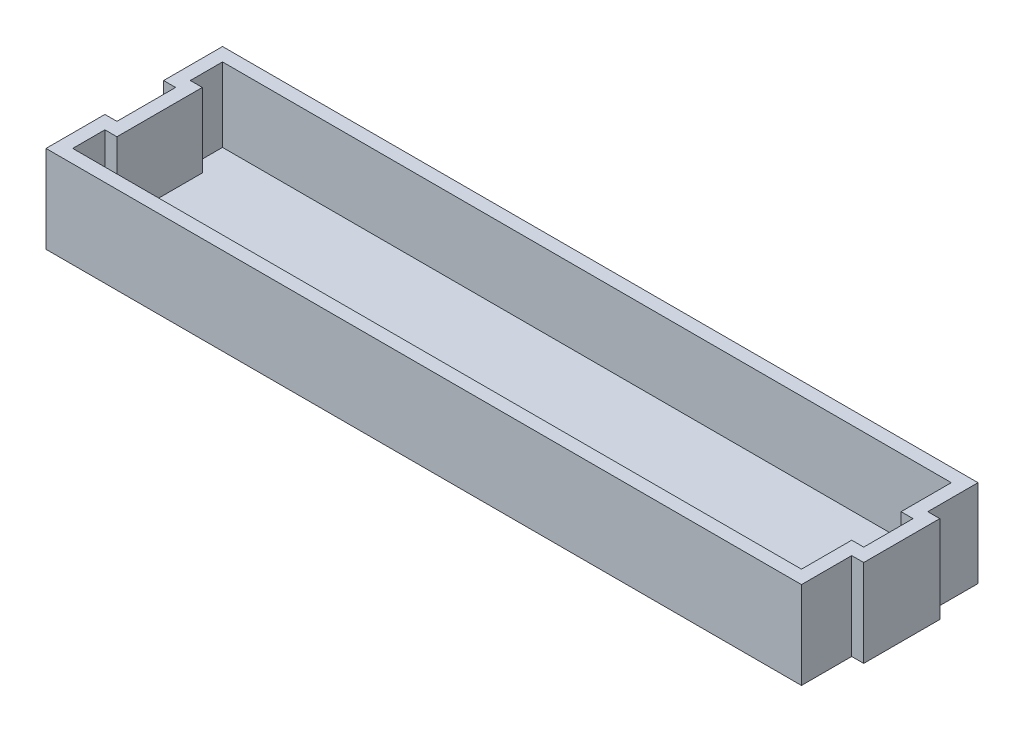
ISO-10303-21;
HEADER;
FILE_DESCRIPTION(('STEP AP214'),'2;1');
FILE_NAME('part.step','',(''),(''),'','','');
FILE_SCHEMA(('AUTOMOTIVE_DESIGN { 1 0 10303 214 1 1 1 1 }'));
ENDSEC;
DATA;
#1=APPLICATION_CONTEXT('core data for automotive mechanical design processes');
#2=APPLICATION_PROTOCOL_DEFINITION('international standard','automotive_design',2000,#1);
#3=PRODUCT_CONTEXT('',#1,'mechanical');
#4=PRODUCT('Part','Part','',(#3));
#5=PRODUCT_RELATED_PRODUCT_CATEGORY('part','',(#4));
#6=PRODUCT_DEFINITION_FORMATION('','',#4);
#7=PRODUCT_DEFINITION_CONTEXT('part definition',#1,'design');
#8=PRODUCT_DEFINITION('design','',#6,#7);
#9=PRODUCT_DEFINITION_SHAPE('','',#8);
#10=(LENGTH_UNIT() NAMED_UNIT(*) SI_UNIT(.MILLI.,.METRE.));
#11=(NAMED_UNIT(*) PLANE_ANGLE_UNIT() SI_UNIT($,.RADIAN.));
#12=(NAMED_UNIT(*) SI_UNIT($,.STERADIAN.) SOLID_ANGLE_UNIT());
#13=UNCERTAINTY_MEASURE_WITH_UNIT(LENGTH_MEASURE(1.E-05),#10,'distance_accuracy_value','');
#14=(GEOMETRIC_REPRESENTATION_CONTEXT(3) GLOBAL_UNCERTAINTY_ASSIGNED_CONTEXT((#13)) GLOBAL_UNIT_ASSIGNED_CONTEXT((#10,
#11,#12)) REPRESENTATION_CONTEXT('',''));
#15=CARTESIAN_POINT('',(0.,0.,0.));
#16=DIRECTION('',(0.,0.,1.));
#17=DIRECTION('',(1.,0.,0.));
#18=AXIS2_PLACEMENT_3D('',#15,#16,#17);
#19=CARTESIAN_POINT('',(-28.31,6.55,-6.615));
#20=DIRECTION('',(1.,0.,0.));
#21=DIRECTION('',(0.,0.,-1.));
#22=AXIS2_PLACEMENT_3D('',#19,#20,#21);
#23=PLANE('',#22);
#24=DIRECTION('',(0.,0.,1.));
#25=VECTOR('',#24,1.);
#26=CARTESIAN_POINT('',(-28.31,0.,-6.615));
#27=LINE('',#26,#25);
#28=CARTESIAN_POINT('',(-28.31,0.,-6.615));
#29=VERTEX_POINT('',#28);
#30=CARTESIAN_POINT('',(-28.31,0.,-2.2));
#31=VERTEX_POINT('',#30);
#32=EDGE_CURVE('E163',#29,#31,#27,.T.);
#33=ORIENTED_EDGE('',*,*,#32,.T.);
#34=DIRECTION('',(0.,-1.,0.));
#35=VECTOR('',#34,1.);
#36=CARTESIAN_POINT('',(-28.31,6.55,-2.2));
#37=LINE('',#36,#35);
#38=CARTESIAN_POINT('',(-28.31,6.55,-2.2));
#39=VERTEX_POINT('',#38);
#40=EDGE_CURVE('E11',#39,#31,#37,.T.);
#41=ORIENTED_EDGE('',*,*,#40,.F.);
#42=DIRECTION('',(0.,0.,1.));
#43=VECTOR('',#42,1.);
#44=CARTESIAN_POINT('',(-28.31,6.55,-6.615));
#45=LINE('',#44,#43);
#46=CARTESIAN_POINT('',(-28.31,6.55,-6.615));
#47=VERTEX_POINT('',#46);
#48=EDGE_CURVE('E187',#47,#39,#45,.T.);
#49=ORIENTED_EDGE('',*,*,#48,.F.);
#50=DIRECTION('',(0.,-1.,0.));
#51=VECTOR('',#50,1.);
#52=CARTESIAN_POINT('',(-28.31,6.55,-6.615));
#53=LINE('',#52,#51);
#54=EDGE_CURVE('E159',#47,#29,#53,.T.);
#55=ORIENTED_EDGE('',*,*,#54,.T.);
#56=EDGE_LOOP('',(#33,#41,#49,#55));
#57=FACE_BOUND('',#56,.T.);
#58=ADVANCED_FACE('F32',(#57),#23,.F.);
#59=CARTESIAN_POINT('',(-28.31,6.55,-2.2));
#60=DIRECTION('',(0.,0.,-1.));
#61=DIRECTION('',(-1.,0.,0.));
#62=AXIS2_PLACEMENT_3D('',#59,#60,#61);
#63=PLANE('',#62);
#64=DIRECTION('',(1.,0.,0.));
#65=VECTOR('',#64,1.);
#66=CARTESIAN_POINT('',(-28.31,0.,-2.2));
#67=LINE('',#66,#65);
#68=CARTESIAN_POINT('',(-27.41,0.,-2.2));
#69=VERTEX_POINT('',#68);
#70=EDGE_CURVE('E166',#31,#69,#67,.T.);
#71=ORIENTED_EDGE('',*,*,#70,.T.);
#72=DIRECTION('',(0.,-1.,0.));
#73=VECTOR('',#72,1.);
#74=CARTESIAN_POINT('',(-27.41,6.55,-2.2));
#75=LINE('',#74,#73);
#76=CARTESIAN_POINT('',(-27.41,6.55,-2.2));
#77=VERTEX_POINT('',#76);
#78=EDGE_CURVE('E39',#77,#69,#75,.T.);
#79=ORIENTED_EDGE('',*,*,#78,.F.);
#80=DIRECTION('',(1.,0.,0.));
#81=VECTOR('',#80,1.);
#82=CARTESIAN_POINT('',(-28.31,6.55,-2.2));
#83=LINE('',#82,#81);
#84=EDGE_CURVE('E108',#39,#77,#83,.T.);
#85=ORIENTED_EDGE('',*,*,#84,.F.);
#86=ORIENTED_EDGE('',*,*,#40,.T.);
#87=EDGE_LOOP('',(#71,#79,#85,#86));
#88=FACE_BOUND('',#87,.T.);
#89=ADVANCED_FACE('F446',(#88),#63,.F.);
#90=CARTESIAN_POINT('',(-27.41,6.55,-2.2));
#91=DIRECTION('',(1.,0.,0.));
#92=DIRECTION('',(0.,0.,-1.));
#93=AXIS2_PLACEMENT_3D('',#90,#91,#92);
#94=PLANE('',#93);
#95=DIRECTION('',(0.,0.,1.));
#96=VECTOR('',#95,1.);
#97=CARTESIAN_POINT('',(-27.41,0.,-2.2));
#98=LINE('',#97,#96);
#99=CARTESIAN_POINT('',(-27.41,0.,2.2));
#100=VERTEX_POINT('',#99);
#101=EDGE_CURVE('E169',#69,#100,#98,.T.);
#102=ORIENTED_EDGE('',*,*,#101,.T.);
#103=DIRECTION('',(0.,-1.,0.));
#104=VECTOR('',#103,1.);
#105=CARTESIAN_POINT('',(-27.41,6.55,2.2));
#106=LINE('',#105,#104);
#107=CARTESIAN_POINT('',(-27.41,6.55,2.2));
#108=VERTEX_POINT('',#107);
#109=EDGE_CURVE('E206',#108,#100,#106,.T.);
#110=ORIENTED_EDGE('',*,*,#109,.F.);
#111=DIRECTION('',(0.,0.,1.));
#112=VECTOR('',#111,1.);
#113=CARTESIAN_POINT('',(-27.41,6.55,-2.2));
#114=LINE('',#113,#112);
#115=EDGE_CURVE('E214',#77,#108,#114,.T.);
#116=ORIENTED_EDGE('',*,*,#115,.F.);
#117=ORIENTED_EDGE('',*,*,#78,.T.);
#118=EDGE_LOOP('',(#102,#110,#116,#117));
#119=FACE_BOUND('',#118,.T.);
#120=ADVANCED_FACE('F212',(#119),#94,.F.);
#121=CARTESIAN_POINT('',(-27.41,6.55,2.2));
#122=DIRECTION('',(0.,0.,1.));
#123=DIRECTION('',(1.,0.,0.));
#124=AXIS2_PLACEMENT_3D('',#121,#122,#123);
#125=PLANE('',#124);
#126=DIRECTION('',(-1.,0.,0.));
#127=VECTOR('',#126,1.);
#128=CARTESIAN_POINT('',(-27.41,0.,2.2));
#129=LINE('',#128,#127);
#130=CARTESIAN_POINT('',(-28.31,0.,2.2));
#131=VERTEX_POINT('',#130);
#132=EDGE_CURVE('E171',#100,#131,#129,.T.);
#133=ORIENTED_EDGE('',*,*,#132,.T.);
#134=DIRECTION('',(0.,-1.,0.));
#135=VECTOR('',#134,1.);
#136=CARTESIAN_POINT('',(-28.31,6.55,2.2));
#137=LINE('',#136,#135);
#138=CARTESIAN_POINT('',(-28.31,6.55,2.2));
#139=VERTEX_POINT('',#138);
#140=EDGE_CURVE('E203',#139,#131,#137,.T.);
#141=ORIENTED_EDGE('',*,*,#140,.F.);
#142=DIRECTION('',(-1.,0.,0.));
#143=VECTOR('',#142,1.);
#144=CARTESIAN_POINT('',(-27.41,6.55,2.2));
#145=LINE('',#144,#143);
#146=EDGE_CURVE('E232',#108,#139,#145,.T.);
#147=ORIENTED_EDGE('',*,*,#146,.F.);
#148=ORIENTED_EDGE('',*,*,#109,.T.);
#149=EDGE_LOOP('',(#133,#141,#147,#148));
#150=FACE_BOUND('',#149,.T.);
#151=ADVANCED_FACE('F223',(#150),#125,.F.);
#152=CARTESIAN_POINT('',(-28.31,6.55,2.2));
#153=DIRECTION('',(1.,0.,0.));
#154=DIRECTION('',(0.,0.,-1.));
#155=AXIS2_PLACEMENT_3D('',#152,#153,#154);
#156=PLANE('',#155);
#157=DIRECTION('',(0.,0.,1.));
#158=VECTOR('',#157,1.);
#159=CARTESIAN_POINT('',(-28.31,0.,2.2));
#160=LINE('',#159,#158);
#161=CARTESIAN_POINT('',(-28.31,0.,6.615));
#162=VERTEX_POINT('',#161);
#163=EDGE_CURVE('E173',#131,#162,#160,.T.);
#164=ORIENTED_EDGE('',*,*,#163,.T.);
#165=DIRECTION('',(0.,-1.,0.));
#166=VECTOR('',#165,1.);
#167=CARTESIAN_POINT('',(-28.31,6.55,6.615));
#168=LINE('',#167,#166);
#169=CARTESIAN_POINT('',(-28.31,6.55,6.615));
#170=VERTEX_POINT('',#169);
#171=EDGE_CURVE('E200',#170,#162,#168,.T.);
#172=ORIENTED_EDGE('',*,*,#171,.F.);
#173=DIRECTION('',(0.,0.,1.));
#174=VECTOR('',#173,1.);
#175=CARTESIAN_POINT('',(-28.31,6.55,2.2));
#176=LINE('',#175,#174);
#177=EDGE_CURVE('E229',#139,#170,#176,.T.);
#178=ORIENTED_EDGE('',*,*,#177,.F.);
#179=ORIENTED_EDGE('',*,*,#140,.T.);
#180=EDGE_LOOP('',(#164,#172,#178,#179));
#181=FACE_BOUND('',#180,.T.);
#182=ADVANCED_FACE('F227',(#181),#156,.F.);
#183=CARTESIAN_POINT('',(-28.31,6.55,6.615));
#184=DIRECTION('',(0.,0.,-1.));
#185=DIRECTION('',(-1.,0.,0.));
#186=AXIS2_PLACEMENT_3D('',#183,#184,#185);
#187=PLANE('',#186);
#188=DIRECTION('',(1.,0.,0.));
#189=VECTOR('',#188,1.);
#190=CARTESIAN_POINT('',(-28.31,0.,6.615));
#191=LINE('',#190,#189);
#192=CARTESIAN_POINT('',(28.31,0.,6.615));
#193=VERTEX_POINT('',#192);
#194=EDGE_CURVE('E175',#162,#193,#191,.T.);
#195=ORIENTED_EDGE('',*,*,#194,.T.);
#196=DIRECTION('',(0.,-1.,0.));
#197=VECTOR('',#196,1.);
#198=CARTESIAN_POINT('',(28.31,6.55,6.615));
#199=LINE('',#198,#197);
#200=CARTESIAN_POINT('',(28.31,6.55,6.615));
#201=VERTEX_POINT('',#200);
#202=EDGE_CURVE('E197',#201,#193,#199,.T.);
#203=ORIENTED_EDGE('',*,*,#202,.F.);
#204=DIRECTION('',(1.,0.,0.));
#205=VECTOR('',#204,1.);
#206=CARTESIAN_POINT('',(-28.31,6.55,6.615));
#207=LINE('',#206,#205);
#208=EDGE_CURVE('E231',#170,#201,#207,.T.);
#209=ORIENTED_EDGE('',*,*,#208,.F.);
#210=ORIENTED_EDGE('',*,*,#171,.T.);
#211=EDGE_LOOP('',(#195,#203,#209,#210));
#212=FACE_BOUND('',#211,.T.);
#213=ADVANCED_FACE('F459',(#212),#187,.F.);
#214=CARTESIAN_POINT('',(28.31,6.55,2.85));
#215=DIRECTION('',(-1.,0.,0.));
#216=DIRECTION('',(0.,0.,1.));
#217=AXIS2_PLACEMENT_3D('',#214,#215,#216);
#218=PLANE('',#217);
#219=DIRECTION('',(0.,0.,-1.));
#220=VECTOR('',#219,1.);
#221=CARTESIAN_POINT('',(28.31,0.,2.85));
#222=LINE('',#221,#220);
#223=CARTESIAN_POINT('',(28.31,0.,2.85));
#224=VERTEX_POINT('',#223);
#225=EDGE_CURVE('E177',#193,#224,#222,.T.);
#226=ORIENTED_EDGE('',*,*,#225,.T.);
#227=DIRECTION('',(0.,-1.,0.));
#228=VECTOR('',#227,1.);
#229=CARTESIAN_POINT('',(28.31,6.55,2.85));
#230=LINE('',#229,#228);
#231=CARTESIAN_POINT('',(28.31,6.55,2.85));
#232=VERTEX_POINT('',#231);
#233=EDGE_CURVE('E194',#232,#224,#230,.T.);
#234=ORIENTED_EDGE('',*,*,#233,.F.);
#235=DIRECTION('',(0.,0.,-1.));
#236=VECTOR('',#235,1.);
#237=CARTESIAN_POINT('',(28.31,6.55,2.85));
#238=LINE('',#237,#236);
#239=EDGE_CURVE('E234',#201,#232,#238,.T.);
#240=ORIENTED_EDGE('',*,*,#239,.F.);
#241=ORIENTED_EDGE('',*,*,#202,.T.);
#242=EDGE_LOOP('',(#226,#234,#240,#241));
#243=FACE_BOUND('',#242,.T.);
#244=ADVANCED_FACE('F462',(#243),#218,.F.);
#245=CARTESIAN_POINT('',(29.21,6.55,2.85));
#246=DIRECTION('',(0.,0.,-1.));
#247=DIRECTION('',(-1.,0.,0.));
#248=AXIS2_PLACEMENT_3D('',#245,#246,#247);
#249=PLANE('',#248);
#250=DIRECTION('',(1.,0.,0.));
#251=VECTOR('',#250,1.);
#252=CARTESIAN_POINT('',(29.21,0.,2.85));
#253=LINE('',#252,#251);
#254=CARTESIAN_POINT('',(29.21,0.,2.85));
#255=VERTEX_POINT('',#254);
#256=EDGE_CURVE('E179',#224,#255,#253,.T.);
#257=ORIENTED_EDGE('',*,*,#256,.T.);
#258=DIRECTION('',(0.,-1.,0.));
#259=VECTOR('',#258,1.);
#260=CARTESIAN_POINT('',(29.21,6.55,2.85));
#261=LINE('',#260,#259);
#262=CARTESIAN_POINT('',(29.21,6.55,2.85));
#263=VERTEX_POINT('',#262);
#264=EDGE_CURVE('E191',#263,#255,#261,.T.);
#265=ORIENTED_EDGE('',*,*,#264,.F.);
#266=DIRECTION('',(1.,0.,0.));
#267=VECTOR('',#266,1.);
#268=CARTESIAN_POINT('',(29.21,6.55,2.85));
#269=LINE('',#268,#267);
#270=EDGE_CURVE('E240',#232,#263,#269,.T.);
#271=ORIENTED_EDGE('',*,*,#270,.F.);
#272=ORIENTED_EDGE('',*,*,#233,.T.);
#273=EDGE_LOOP('',(#257,#265,#271,#272));
#274=FACE_BOUND('',#273,.T.);
#275=ADVANCED_FACE('F246',(#274),#249,.F.);
#276=CARTESIAN_POINT('',(29.21,6.55,-2.85));
#277=DIRECTION('',(-1.,0.,0.));
#278=DIRECTION('',(0.,0.,1.));
#279=AXIS2_PLACEMENT_3D('',#276,#277,#278);
#280=PLANE('',#279);
#281=DIRECTION('',(0.,0.,-1.));
#282=VECTOR('',#281,1.);
#283=CARTESIAN_POINT('',(29.21,0.,-2.85));
#284=LINE('',#283,#282);
#285=CARTESIAN_POINT('',(29.21,0.,-2.85));
#286=VERTEX_POINT('',#285);
#287=EDGE_CURVE('E181',#255,#286,#284,.T.);
#288=ORIENTED_EDGE('',*,*,#287,.T.);
#289=DIRECTION('',(0.,-1.,0.));
#290=VECTOR('',#289,1.);
#291=CARTESIAN_POINT('',(29.21,6.55,-2.85));
#292=LINE('',#291,#290);
#293=CARTESIAN_POINT('',(29.21,6.55,-2.85));
#294=VERTEX_POINT('',#293);
#295=EDGE_CURVE('E154',#294,#286,#292,.T.);
#296=ORIENTED_EDGE('',*,*,#295,.F.);
#297=DIRECTION('',(0.,0.,-1.));
#298=VECTOR('',#297,1.);
#299=CARTESIAN_POINT('',(29.21,6.55,-2.85));
#300=LINE('',#299,#298);
#301=EDGE_CURVE('E142',#263,#294,#300,.T.);
#302=ORIENTED_EDGE('',*,*,#301,.F.);
#303=ORIENTED_EDGE('',*,*,#264,.T.);
#304=EDGE_LOOP('',(#288,#296,#302,#303));
#305=FACE_BOUND('',#304,.T.);
#306=ADVANCED_FACE('F250',(#305),#280,.F.);
#307=CARTESIAN_POINT('',(28.31,6.55,-2.85));
#308=DIRECTION('',(0.,0.,1.));
#309=DIRECTION('',(1.,0.,0.));
#310=AXIS2_PLACEMENT_3D('',#307,#308,#309);
#311=PLANE('',#310);
#312=DIRECTION('',(-1.,0.,0.));
#313=VECTOR('',#312,1.);
#314=CARTESIAN_POINT('',(28.31,0.,-2.85));
#315=LINE('',#314,#313);
#316=CARTESIAN_POINT('',(28.31,0.,-2.85));
#317=VERTEX_POINT('',#316);
#318=EDGE_CURVE('E151',#286,#317,#315,.T.);
#319=ORIENTED_EDGE('',*,*,#318,.T.);
#320=DIRECTION('',(0.,-1.,0.));
#321=VECTOR('',#320,1.);
#322=CARTESIAN_POINT('',(28.31,6.55,-2.85));
#323=LINE('',#322,#321);
#324=CARTESIAN_POINT('',(28.31,6.55,-2.85));
#325=VERTEX_POINT('',#324);
#326=EDGE_CURVE('E148',#325,#317,#323,.T.);
#327=ORIENTED_EDGE('',*,*,#326,.F.);
#328=DIRECTION('',(-1.,0.,0.));
#329=VECTOR('',#328,1.);
#330=CARTESIAN_POINT('',(28.31,6.55,-2.85));
#331=LINE('',#330,#329);
#332=EDGE_CURVE('E135',#294,#325,#331,.T.);
#333=ORIENTED_EDGE('',*,*,#332,.F.);
#334=ORIENTED_EDGE('',*,*,#295,.T.);
#335=EDGE_LOOP('',(#319,#327,#333,#334));
#336=FACE_BOUND('',#335,.T.);
#337=ADVANCED_FACE('F149',(#336),#311,.F.);
#338=CARTESIAN_POINT('',(28.31,6.55,-6.615));
#339=DIRECTION('',(-1.,0.,0.));
#340=DIRECTION('',(0.,0.,1.));
#341=AXIS2_PLACEMENT_3D('',#338,#339,#340);
#342=PLANE('',#341);
#343=DIRECTION('',(0.,0.,-1.));
#344=VECTOR('',#343,1.);
#345=CARTESIAN_POINT('',(28.31,0.,-6.615));
#346=LINE('',#345,#344);
#347=CARTESIAN_POINT('',(28.31,0.,-6.615));
#348=VERTEX_POINT('',#347);
#349=EDGE_CURVE('E184',#317,#348,#346,.T.);
#350=ORIENTED_EDGE('',*,*,#349,.T.);
#351=DIRECTION('',(0.,-1.,0.));
#352=VECTOR('',#351,1.);
#353=CARTESIAN_POINT('',(28.31,6.55,-6.615));
#354=LINE('',#353,#352);
#355=CARTESIAN_POINT('',(28.31,6.55,-6.615));
#356=VERTEX_POINT('',#355);
#357=EDGE_CURVE('E155',#356,#348,#354,.T.);
#358=ORIENTED_EDGE('',*,*,#357,.F.);
#359=DIRECTION('',(0.,0.,-1.));
#360=VECTOR('',#359,1.);
#361=CARTESIAN_POINT('',(28.31,6.55,-6.615));
#362=LINE('',#361,#360);
#363=EDGE_CURVE('E139',#325,#356,#362,.T.);
#364=ORIENTED_EDGE('',*,*,#363,.F.);
#365=ORIENTED_EDGE('',*,*,#326,.T.);
#366=EDGE_LOOP('',(#350,#358,#364,#365));
#367=FACE_BOUND('',#366,.T.);
#368=ADVANCED_FACE('F157',(#367),#342,.F.);
#369=CARTESIAN_POINT('',(-28.31,6.55,-6.615));
#370=DIRECTION('',(0.,0.,1.));
#371=DIRECTION('',(1.,0.,0.));
#372=AXIS2_PLACEMENT_3D('',#369,#370,#371);
#373=PLANE('',#372);
#374=DIRECTION('',(-1.,0.,0.));
#375=VECTOR('',#374,1.);
#376=CARTESIAN_POINT('',(-28.31,0.,-6.615));
#377=LINE('',#376,#375);
#378=EDGE_CURVE('E100',#348,#29,#377,.T.);
#379=ORIENTED_EDGE('',*,*,#378,.T.);
#380=ORIENTED_EDGE('',*,*,#54,.F.);
#381=DIRECTION('',(-1.,0.,0.));
#382=VECTOR('',#381,1.);
#383=CARTESIAN_POINT('',(-28.31,6.55,-6.615));
#384=LINE('',#383,#382);
#385=EDGE_CURVE('E55',#356,#47,#384,.T.);
#386=ORIENTED_EDGE('',*,*,#385,.F.);
#387=ORIENTED_EDGE('',*,*,#357,.T.);
#388=EDGE_LOOP('',(#379,#380,#386,#387));
#389=FACE_BOUND('',#388,.T.);
#390=ADVANCED_FACE('F251',(#389),#373,.F.);
#391=CARTESIAN_POINT('',(0.,6.55,0.));
#392=DIRECTION('',(0.,1.,0.));
#393=DIRECTION('',(0.,0.,1.));
#394=AXIS2_PLACEMENT_3D('',#391,#392,#393);
#395=PLANE('',#394);
#396=DIRECTION('',(0.,0.,1.));
#397=VECTOR('',#396,1.);
#398=CARTESIAN_POINT('',(-27.31,6.55,-6.615));
#399=LINE('',#398,#397);
#400=CARTESIAN_POINT('',(-27.31,6.55,-5.615));
#401=VERTEX_POINT('',#400);
#402=CARTESIAN_POINT('',(-27.31,6.55,-3.2));
#403=VERTEX_POINT('',#402);
#404=EDGE_CURVE('E290',#401,#403,#399,.T.);
#405=ORIENTED_EDGE('',*,*,#404,.F.);
#406=DIRECTION('',(-1.,0.,0.));
#407=VECTOR('',#406,1.);
#408=CARTESIAN_POINT('',(-28.31,6.55,-5.615));
#409=LINE('',#408,#407);
#410=CARTESIAN_POINT('',(27.31,6.55,-5.615));
#411=VERTEX_POINT('',#410);
#412=EDGE_CURVE('E258',#411,#401,#409,.T.);
#413=ORIENTED_EDGE('',*,*,#412,.F.);
#414=DIRECTION('',(0.,0.,-1.));
#415=VECTOR('',#414,1.);
#416=CARTESIAN_POINT('',(27.31,6.55,-6.615));
#417=LINE('',#416,#415);
#418=CARTESIAN_POINT('',(27.31,6.55,-1.85));
#419=VERTEX_POINT('',#418);
#420=EDGE_CURVE('E261',#419,#411,#417,.T.);
#421=ORIENTED_EDGE('',*,*,#420,.F.);
#422=DIRECTION('',(-1.,0.,0.));
#423=VECTOR('',#422,1.);
#424=CARTESIAN_POINT('',(28.31,6.55,-1.85));
#425=LINE('',#424,#423);
#426=CARTESIAN_POINT('',(28.21,6.55,-1.85));
#427=VERTEX_POINT('',#426);
#428=EDGE_CURVE('E263',#427,#419,#425,.T.);
#429=ORIENTED_EDGE('',*,*,#428,.F.);
#430=DIRECTION('',(0.,0.,-1.));
#431=VECTOR('',#430,1.);
#432=CARTESIAN_POINT('',(28.21,6.55,-2.85));
#433=LINE('',#432,#431);
#434=CARTESIAN_POINT('',(28.21,6.55,1.85));
#435=VERTEX_POINT('',#434);
#436=EDGE_CURVE('E266',#435,#427,#433,.T.);
#437=ORIENTED_EDGE('',*,*,#436,.F.);
#438=DIRECTION('',(1.,0.,0.));
#439=VECTOR('',#438,1.);
#440=CARTESIAN_POINT('',(29.21,6.55,1.85));
#441=LINE('',#440,#439);
#442=CARTESIAN_POINT('',(27.31,6.55,1.85));
#443=VERTEX_POINT('',#442);
#444=EDGE_CURVE('E269',#443,#435,#441,.T.);
#445=ORIENTED_EDGE('',*,*,#444,.F.);
#446=DIRECTION('',(0.,0.,-1.));
#447=VECTOR('',#446,1.);
#448=CARTESIAN_POINT('',(27.31,6.55,2.85));
#449=LINE('',#448,#447);
#450=CARTESIAN_POINT('',(27.31,6.55,5.615));
#451=VERTEX_POINT('',#450);
#452=EDGE_CURVE('E272',#451,#443,#449,.T.);
#453=ORIENTED_EDGE('',*,*,#452,.F.);
#454=DIRECTION('',(1.,0.,0.));
#455=VECTOR('',#454,1.);
#456=CARTESIAN_POINT('',(-28.31,6.55,5.615));
#457=LINE('',#456,#455);
#458=CARTESIAN_POINT('',(-27.31,6.55,5.615));
#459=VERTEX_POINT('',#458);
#460=EDGE_CURVE('E275',#459,#451,#457,.T.);
#461=ORIENTED_EDGE('',*,*,#460,.F.);
#462=DIRECTION('',(0.,0.,1.));
#463=VECTOR('',#462,1.);
#464=CARTESIAN_POINT('',(-27.31,6.55,2.2));
#465=LINE('',#464,#463);
#466=CARTESIAN_POINT('',(-27.31,6.55,3.2));
#467=VERTEX_POINT('',#466);
#468=EDGE_CURVE('E278',#467,#459,#465,.T.);
#469=ORIENTED_EDGE('',*,*,#468,.F.);
#470=DIRECTION('',(-1.,0.,0.));
#471=VECTOR('',#470,1.);
#472=CARTESIAN_POINT('',(-27.41,6.55,3.2));
#473=LINE('',#472,#471);
#474=CARTESIAN_POINT('',(-26.41,6.55,3.2));
#475=VERTEX_POINT('',#474);
#476=EDGE_CURVE('E281',#475,#467,#473,.T.);
#477=ORIENTED_EDGE('',*,*,#476,.F.);
#478=DIRECTION('',(0.,0.,1.));
#479=VECTOR('',#478,1.);
#480=CARTESIAN_POINT('',(-26.41,6.55,-2.2));
#481=LINE('',#480,#479);
#482=CARTESIAN_POINT('',(-26.41,6.55,-3.2));
#483=VERTEX_POINT('',#482);
#484=EDGE_CURVE('E284',#483,#475,#481,.T.);
#485=ORIENTED_EDGE('',*,*,#484,.F.);
#486=DIRECTION('',(1.,0.,0.));
#487=VECTOR('',#486,1.);
#488=CARTESIAN_POINT('',(-28.31,6.55,-3.2));
#489=LINE('',#488,#487);
#490=EDGE_CURVE('E287',#403,#483,#489,.T.);
#491=ORIENTED_EDGE('',*,*,#490,.F.);
#492=EDGE_LOOP('',(#405,#413,#421,#429,#437,#445,#453,#461,#469,#477,#485,#491));
#493=FACE_BOUND('',#492,.T.);
#494=ORIENTED_EDGE('',*,*,#48,.T.);
#495=ORIENTED_EDGE('',*,*,#84,.T.);
#496=ORIENTED_EDGE('',*,*,#115,.T.);
#497=ORIENTED_EDGE('',*,*,#146,.T.);
#498=ORIENTED_EDGE('',*,*,#177,.T.);
#499=ORIENTED_EDGE('',*,*,#208,.T.);
#500=ORIENTED_EDGE('',*,*,#239,.T.);
#501=ORIENTED_EDGE('',*,*,#270,.T.);
#502=ORIENTED_EDGE('',*,*,#301,.T.);
#503=ORIENTED_EDGE('',*,*,#332,.T.);
#504=ORIENTED_EDGE('',*,*,#363,.T.);
#505=ORIENTED_EDGE('',*,*,#385,.T.);
#506=EDGE_LOOP('',(#494,#495,#496,#497,#498,#499,#500,#501,#502,#503,#504,#505));
#507=FACE_BOUND('',#506,.T.);
#508=ADVANCED_FACE('F137',(#493,#507),#395,.T.);
#509=CARTESIAN_POINT('',(0.,0.,0.));
#510=DIRECTION('',(0.,1.,0.));
#511=DIRECTION('',(0.,0.,1.));
#512=AXIS2_PLACEMENT_3D('',#509,#510,#511);
#513=PLANE('',#512);
#514=ORIENTED_EDGE('',*,*,#32,.F.);
#515=ORIENTED_EDGE('',*,*,#378,.F.);
#516=ORIENTED_EDGE('',*,*,#349,.F.);
#517=ORIENTED_EDGE('',*,*,#318,.F.);
#518=ORIENTED_EDGE('',*,*,#287,.F.);
#519=ORIENTED_EDGE('',*,*,#256,.F.);
#520=ORIENTED_EDGE('',*,*,#225,.F.);
#521=ORIENTED_EDGE('',*,*,#194,.F.);
#522=ORIENTED_EDGE('',*,*,#163,.F.);
#523=ORIENTED_EDGE('',*,*,#132,.F.);
#524=ORIENTED_EDGE('',*,*,#101,.F.);
#525=ORIENTED_EDGE('',*,*,#70,.F.);
#526=EDGE_LOOP('',(#514,#515,#516,#517,#518,#519,#520,#521,#522,#523,#524,#525));
#527=FACE_BOUND('',#526,.T.);
#528=ADVANCED_FACE('F218',(#527),#513,.F.);
#529=CARTESIAN_POINT('',(-27.31,6.55,-6.615));
#530=DIRECTION('',(1.,0.,0.));
#531=DIRECTION('',(0.,0.,-1.));
#532=AXIS2_PLACEMENT_3D('',#529,#530,#531);
#533=PLANE('',#532);
#534=DIRECTION('',(0.,0.,1.));
#535=VECTOR('',#534,1.);
#536=CARTESIAN_POINT('',(-27.31,1.,-6.615));
#537=LINE('',#536,#535);
#538=CARTESIAN_POINT('',(-27.31,1.,-5.615));
#539=VERTEX_POINT('',#538);
#540=CARTESIAN_POINT('',(-27.31,1.,-3.2));
#541=VERTEX_POINT('',#540);
#542=EDGE_CURVE('E354',#539,#541,#537,.T.);
#543=ORIENTED_EDGE('',*,*,#542,.F.);
#544=DIRECTION('',(0.,-1.,0.));
#545=VECTOR('',#544,1.);
#546=CARTESIAN_POINT('',(-27.31,6.55,-5.615));
#547=LINE('',#546,#545);
#548=EDGE_CURVE('E260',#401,#539,#547,.T.);
#549=ORIENTED_EDGE('',*,*,#548,.F.);
#550=ORIENTED_EDGE('',*,*,#404,.T.);
#551=DIRECTION('',(0.,-1.,0.));
#552=VECTOR('',#551,1.);
#553=CARTESIAN_POINT('',(-27.31,6.55,-3.2));
#554=LINE('',#553,#552);
#555=EDGE_CURVE('E167',#403,#541,#554,.T.);
#556=ORIENTED_EDGE('',*,*,#555,.T.);
#557=EDGE_LOOP('',(#543,#549,#550,#556));
#558=FACE_BOUND('',#557,.T.);
#559=ADVANCED_FACE('F370',(#558),#533,.T.);
#560=CARTESIAN_POINT('',(-28.31,6.55,-3.2));
#561=DIRECTION('',(0.,0.,-1.));
#562=DIRECTION('',(-1.,0.,0.));
#563=AXIS2_PLACEMENT_3D('',#560,#561,#562);
#564=PLANE('',#563);
#565=DIRECTION('',(1.,0.,0.));
#566=VECTOR('',#565,1.);
#567=CARTESIAN_POINT('',(-28.31,1.,-3.2));
#568=LINE('',#567,#566);
#569=CARTESIAN_POINT('',(-26.41,1.,-3.2));
#570=VERTEX_POINT('',#569);
#571=EDGE_CURVE('E349',#541,#570,#568,.T.);
#572=ORIENTED_EDGE('',*,*,#571,.F.);
#573=ORIENTED_EDGE('',*,*,#555,.F.);
#574=ORIENTED_EDGE('',*,*,#490,.T.);
#575=DIRECTION('',(0.,-1.,0.));
#576=VECTOR('',#575,1.);
#577=CARTESIAN_POINT('',(-26.41,6.55,-3.2));
#578=LINE('',#577,#576);
#579=EDGE_CURVE('E346',#483,#570,#578,.T.);
#580=ORIENTED_EDGE('',*,*,#579,.T.);
#581=EDGE_LOOP('',(#572,#573,#574,#580));
#582=FACE_BOUND('',#581,.T.);
#583=ADVANCED_FACE('F408',(#582),#564,.T.);
#584=CARTESIAN_POINT('',(-26.41,6.55,-2.2));
#585=DIRECTION('',(1.,0.,0.));
#586=DIRECTION('',(0.,0.,-1.));
#587=AXIS2_PLACEMENT_3D('',#584,#585,#586);
#588=PLANE('',#587);
#589=DIRECTION('',(0.,0.,1.));
#590=VECTOR('',#589,1.);
#591=CARTESIAN_POINT('',(-26.41,1.,-2.2));
#592=LINE('',#591,#590);
#593=CARTESIAN_POINT('',(-26.41,1.,3.2));
#594=VERTEX_POINT('',#593);
#595=EDGE_CURVE('E343',#570,#594,#592,.T.);
#596=ORIENTED_EDGE('',*,*,#595,.F.);
#597=ORIENTED_EDGE('',*,*,#579,.F.);
#598=ORIENTED_EDGE('',*,*,#484,.T.);
#599=DIRECTION('',(0.,-1.,0.));
#600=VECTOR('',#599,1.);
#601=CARTESIAN_POINT('',(-26.41,6.55,3.2));
#602=LINE('',#601,#600);
#603=EDGE_CURVE('E340',#475,#594,#602,.T.);
#604=ORIENTED_EDGE('',*,*,#603,.T.);
#605=EDGE_LOOP('',(#596,#597,#598,#604));
#606=FACE_BOUND('',#605,.T.);
#607=ADVANCED_FACE('F414',(#606),#588,.T.);
#608=CARTESIAN_POINT('',(-27.41,6.55,3.2));
#609=DIRECTION('',(0.,0.,1.));
#610=DIRECTION('',(1.,0.,0.));
#611=AXIS2_PLACEMENT_3D('',#608,#609,#610);
#612=PLANE('',#611);
#613=DIRECTION('',(-1.,0.,0.));
#614=VECTOR('',#613,1.);
#615=CARTESIAN_POINT('',(-27.41,1.,3.2));
#616=LINE('',#615,#614);
#617=CARTESIAN_POINT('',(-27.31,1.,3.2));
#618=VERTEX_POINT('',#617);
#619=EDGE_CURVE('E337',#594,#618,#616,.T.);
#620=ORIENTED_EDGE('',*,*,#619,.F.);
#621=ORIENTED_EDGE('',*,*,#603,.F.);
#622=ORIENTED_EDGE('',*,*,#476,.T.);
#623=DIRECTION('',(0.,-1.,0.));
#624=VECTOR('',#623,1.);
#625=CARTESIAN_POINT('',(-27.31,6.55,3.2));
#626=LINE('',#625,#624);
#627=EDGE_CURVE('E334',#467,#618,#626,.T.);
#628=ORIENTED_EDGE('',*,*,#627,.T.);
#629=EDGE_LOOP('',(#620,#621,#622,#628));
#630=FACE_BOUND('',#629,.T.);
#631=ADVANCED_FACE('F547',(#630),#612,.T.);
#632=CARTESIAN_POINT('',(-27.31,6.55,2.2));
#633=DIRECTION('',(1.,0.,0.));
#634=DIRECTION('',(0.,0.,-1.));
#635=AXIS2_PLACEMENT_3D('',#632,#633,#634);
#636=PLANE('',#635);
#637=DIRECTION('',(0.,0.,1.));
#638=VECTOR('',#637,1.);
#639=CARTESIAN_POINT('',(-27.31,1.,2.2));
#640=LINE('',#639,#638);
#641=CARTESIAN_POINT('',(-27.31,1.,5.615));
#642=VERTEX_POINT('',#641);
#643=EDGE_CURVE('E331',#618,#642,#640,.T.);
#644=ORIENTED_EDGE('',*,*,#643,.F.);
#645=ORIENTED_EDGE('',*,*,#627,.F.);
#646=ORIENTED_EDGE('',*,*,#468,.T.);
#647=DIRECTION('',(0.,-1.,0.));
#648=VECTOR('',#647,1.);
#649=CARTESIAN_POINT('',(-27.31,6.55,5.615));
#650=LINE('',#649,#648);
#651=EDGE_CURVE('E328',#459,#642,#650,.T.);
#652=ORIENTED_EDGE('',*,*,#651,.T.);
#653=EDGE_LOOP('',(#644,#645,#646,#652));
#654=FACE_BOUND('',#653,.T.);
#655=ADVANCED_FACE('F537',(#654),#636,.T.);
#656=CARTESIAN_POINT('',(-28.31,6.55,5.615));
#657=DIRECTION('',(0.,0.,-1.));
#658=DIRECTION('',(-1.,0.,0.));
#659=AXIS2_PLACEMENT_3D('',#656,#657,#658);
#660=PLANE('',#659);
#661=DIRECTION('',(1.,0.,0.));
#662=VECTOR('',#661,1.);
#663=CARTESIAN_POINT('',(-28.31,1.,5.615));
#664=LINE('',#663,#662);
#665=CARTESIAN_POINT('',(27.31,1.,5.615));
#666=VERTEX_POINT('',#665);
#667=EDGE_CURVE('E325',#642,#666,#664,.T.);
#668=ORIENTED_EDGE('',*,*,#667,.F.);
#669=ORIENTED_EDGE('',*,*,#651,.F.);
#670=ORIENTED_EDGE('',*,*,#460,.T.);
#671=DIRECTION('',(0.,-1.,0.));
#672=VECTOR('',#671,1.);
#673=CARTESIAN_POINT('',(27.31,6.55,5.615));
#674=LINE('',#673,#672);
#675=EDGE_CURVE('E322',#451,#666,#674,.T.);
#676=ORIENTED_EDGE('',*,*,#675,.T.);
#677=EDGE_LOOP('',(#668,#669,#670,#676));
#678=FACE_BOUND('',#677,.T.);
#679=ADVANCED_FACE('F527',(#678),#660,.T.);
#680=CARTESIAN_POINT('',(27.31,6.55,2.85));
#681=DIRECTION('',(-1.,0.,0.));
#682=DIRECTION('',(0.,0.,1.));
#683=AXIS2_PLACEMENT_3D('',#680,#681,#682);
#684=PLANE('',#683);
#685=DIRECTION('',(0.,0.,-1.));
#686=VECTOR('',#685,1.);
#687=CARTESIAN_POINT('',(27.31,1.,2.85));
#688=LINE('',#687,#686);
#689=CARTESIAN_POINT('',(27.31,1.,1.85));
#690=VERTEX_POINT('',#689);
#691=EDGE_CURVE('E319',#666,#690,#688,.T.);
#692=ORIENTED_EDGE('',*,*,#691,.F.);
#693=ORIENTED_EDGE('',*,*,#675,.F.);
#694=ORIENTED_EDGE('',*,*,#452,.T.);
#695=DIRECTION('',(0.,-1.,0.));
#696=VECTOR('',#695,1.);
#697=CARTESIAN_POINT('',(27.31,6.55,1.85));
#698=LINE('',#697,#696);
#699=EDGE_CURVE('E316',#443,#690,#698,.T.);
#700=ORIENTED_EDGE('',*,*,#699,.T.);
#701=EDGE_LOOP('',(#692,#693,#694,#700));
#702=FACE_BOUND('',#701,.T.);
#703=ADVANCED_FACE('F517',(#702),#684,.T.);
#704=CARTESIAN_POINT('',(29.21,6.55,1.85));
#705=DIRECTION('',(0.,0.,-1.));
#706=DIRECTION('',(-1.,0.,0.));
#707=AXIS2_PLACEMENT_3D('',#704,#705,#706);
#708=PLANE('',#707);
#709=DIRECTION('',(1.,0.,0.));
#710=VECTOR('',#709,1.);
#711=CARTESIAN_POINT('',(29.21,1.,1.85));
#712=LINE('',#711,#710);
#713=CARTESIAN_POINT('',(28.21,1.,1.85));
#714=VERTEX_POINT('',#713);
#715=EDGE_CURVE('E313',#690,#714,#712,.T.);
#716=ORIENTED_EDGE('',*,*,#715,.F.);
#717=ORIENTED_EDGE('',*,*,#699,.F.);
#718=ORIENTED_EDGE('',*,*,#444,.T.);
#719=DIRECTION('',(0.,-1.,0.));
#720=VECTOR('',#719,1.);
#721=CARTESIAN_POINT('',(28.21,6.55,1.85));
#722=LINE('',#721,#720);
#723=EDGE_CURVE('E310',#435,#714,#722,.T.);
#724=ORIENTED_EDGE('',*,*,#723,.T.);
#725=EDGE_LOOP('',(#716,#717,#718,#724));
#726=FACE_BOUND('',#725,.T.);
#727=ADVANCED_FACE('F507',(#726),#708,.T.);
#728=CARTESIAN_POINT('',(28.21,6.55,-2.85));
#729=DIRECTION('',(-1.,0.,0.));
#730=DIRECTION('',(0.,0.,1.));
#731=AXIS2_PLACEMENT_3D('',#728,#729,#730);
#732=PLANE('',#731);
#733=DIRECTION('',(0.,0.,-1.));
#734=VECTOR('',#733,1.);
#735=CARTESIAN_POINT('',(28.21,1.,-2.85));
#736=LINE('',#735,#734);
#737=CARTESIAN_POINT('',(28.21,1.,-1.85));
#738=VERTEX_POINT('',#737);
#739=EDGE_CURVE('E307',#714,#738,#736,.T.);
#740=ORIENTED_EDGE('',*,*,#739,.F.);
#741=ORIENTED_EDGE('',*,*,#723,.F.);
#742=ORIENTED_EDGE('',*,*,#436,.T.);
#743=DIRECTION('',(0.,-1.,0.));
#744=VECTOR('',#743,1.);
#745=CARTESIAN_POINT('',(28.21,6.55,-1.85));
#746=LINE('',#745,#744);
#747=EDGE_CURVE('E304',#427,#738,#746,.T.);
#748=ORIENTED_EDGE('',*,*,#747,.T.);
#749=EDGE_LOOP('',(#740,#741,#742,#748));
#750=FACE_BOUND('',#749,.T.);
#751=ADVANCED_FACE('F443',(#750),#732,.T.);
#752=CARTESIAN_POINT('',(28.31,6.55,-1.85));
#753=DIRECTION('',(0.,0.,1.));
#754=DIRECTION('',(1.,0.,0.));
#755=AXIS2_PLACEMENT_3D('',#752,#753,#754);
#756=PLANE('',#755);
#757=DIRECTION('',(-1.,0.,0.));
#758=VECTOR('',#757,1.);
#759=CARTESIAN_POINT('',(28.31,1.,-1.85));
#760=LINE('',#759,#758);
#761=CARTESIAN_POINT('',(27.31,1.,-1.85));
#762=VERTEX_POINT('',#761);
#763=EDGE_CURVE('E301',#738,#762,#760,.T.);
#764=ORIENTED_EDGE('',*,*,#763,.F.);
#765=ORIENTED_EDGE('',*,*,#747,.F.);
#766=ORIENTED_EDGE('',*,*,#428,.T.);
#767=DIRECTION('',(0.,-1.,0.));
#768=VECTOR('',#767,1.);
#769=CARTESIAN_POINT('',(27.31,6.55,-1.85));
#770=LINE('',#769,#768);
#771=EDGE_CURVE('E298',#419,#762,#770,.T.);
#772=ORIENTED_EDGE('',*,*,#771,.T.);
#773=EDGE_LOOP('',(#764,#765,#766,#772));
#774=FACE_BOUND('',#773,.T.);
#775=ADVANCED_FACE('F433',(#774),#756,.T.);
#776=CARTESIAN_POINT('',(27.31,6.55,-6.615));
#777=DIRECTION('',(-1.,0.,0.));
#778=DIRECTION('',(0.,0.,1.));
#779=AXIS2_PLACEMENT_3D('',#776,#777,#778);
#780=PLANE('',#779);
#781=DIRECTION('',(0.,0.,-1.));
#782=VECTOR('',#781,1.);
#783=CARTESIAN_POINT('',(27.31,1.,-6.615));
#784=LINE('',#783,#782);
#785=CARTESIAN_POINT('',(27.31,1.,-5.615));
#786=VERTEX_POINT('',#785);
#787=EDGE_CURVE('E296',#762,#786,#784,.T.);
#788=ORIENTED_EDGE('',*,*,#787,.F.);
#789=ORIENTED_EDGE('',*,*,#771,.F.);
#790=ORIENTED_EDGE('',*,*,#420,.T.);
#791=DIRECTION('',(0.,-1.,0.));
#792=VECTOR('',#791,1.);
#793=CARTESIAN_POINT('',(27.31,6.55,-5.615));
#794=LINE('',#793,#792);
#795=EDGE_CURVE('E46',#411,#786,#794,.T.);
#796=ORIENTED_EDGE('',*,*,#795,.T.);
#797=EDGE_LOOP('',(#788,#789,#790,#796));
#798=FACE_BOUND('',#797,.T.);
#799=ADVANCED_FACE('F435',(#798),#780,.T.);
#800=CARTESIAN_POINT('',(-28.31,6.55,-5.615));
#801=DIRECTION('',(0.,0.,1.));
#802=DIRECTION('',(1.,0.,0.));
#803=AXIS2_PLACEMENT_3D('',#800,#801,#802);
#804=PLANE('',#803);
#805=DIRECTION('',(-1.,0.,0.));
#806=VECTOR('',#805,1.);
#807=CARTESIAN_POINT('',(-28.31,1.,-5.615));
#808=LINE('',#807,#806);
#809=EDGE_CURVE('E293',#786,#539,#808,.T.);
#810=ORIENTED_EDGE('',*,*,#809,.F.);
#811=ORIENTED_EDGE('',*,*,#795,.F.);
#812=ORIENTED_EDGE('',*,*,#412,.T.);
#813=ORIENTED_EDGE('',*,*,#548,.T.);
#814=EDGE_LOOP('',(#810,#811,#812,#813));
#815=FACE_BOUND('',#814,.T.);
#816=ADVANCED_FACE('F402',(#815),#804,.T.);
#817=CARTESIAN_POINT('',(0.,1.,0.));
#818=DIRECTION('',(0.,1.,0.));
#819=DIRECTION('',(0.,0.,1.));
#820=AXIS2_PLACEMENT_3D('',#817,#818,#819);
#821=PLANE('',#820);
#822=ORIENTED_EDGE('',*,*,#542,.T.);
#823=ORIENTED_EDGE('',*,*,#571,.T.);
#824=ORIENTED_EDGE('',*,*,#595,.T.);
#825=ORIENTED_EDGE('',*,*,#619,.T.);
#826=ORIENTED_EDGE('',*,*,#643,.T.);
#827=ORIENTED_EDGE('',*,*,#667,.T.);
#828=ORIENTED_EDGE('',*,*,#691,.T.);
#829=ORIENTED_EDGE('',*,*,#715,.T.);
#830=ORIENTED_EDGE('',*,*,#739,.T.);
#831=ORIENTED_EDGE('',*,*,#763,.T.);
#832=ORIENTED_EDGE('',*,*,#787,.T.);
#833=ORIENTED_EDGE('',*,*,#809,.T.);
#834=EDGE_LOOP('',(#822,#823,#824,#825,#826,#827,#828,#829,#830,#831,#832,#833));
#835=FACE_BOUND('',#834,.T.);
#836=ADVANCED_FACE('F363',(#835),#821,.T.);
#837=CLOSED_SHELL('',(#58,#89,#120,#151,#182,#213,#244,#275,#306,#337,#368,#390,#508,#528,#559,
#583,#607,#631,#655,#679,#703,#727,#751,#775,#799,#816,#836));
#838=MANIFOLD_SOLID_BREP('B2',#837);
#839=ADVANCED_BREP_SHAPE_REPRESENTATION('',(#18,#838),#14);
#840=SHAPE_DEFINITION_REPRESENTATION(#9,#839);
ENDSEC;
END-ISO-10303-21;
